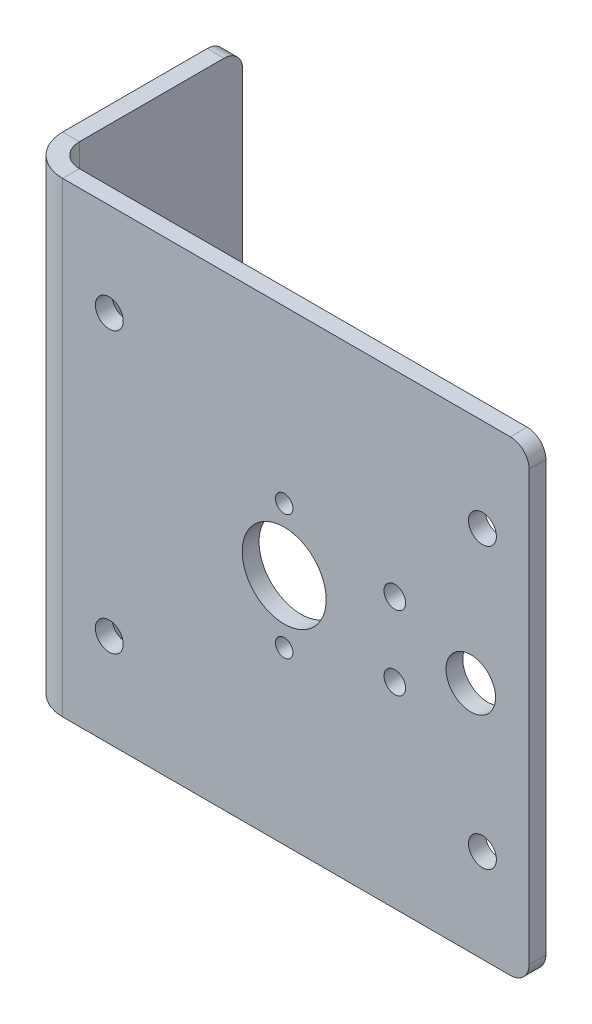
ISO-10303-21;
HEADER;
FILE_DESCRIPTION(('STEP AP214'),'2;1');
FILE_NAME('part.step','',(''),(''),'','','');
FILE_SCHEMA(('AUTOMOTIVE_DESIGN { 1 0 10303 214 1 1 1 1 }'));
ENDSEC;
DATA;
#1=APPLICATION_CONTEXT('core data for automotive mechanical design processes');
#2=APPLICATION_PROTOCOL_DEFINITION('international standard','automotive_design',2000,#1);
#3=PRODUCT_CONTEXT('',#1,'mechanical');
#4=PRODUCT('Part','Part','',(#3));
#5=PRODUCT_RELATED_PRODUCT_CATEGORY('part','',(#4));
#6=PRODUCT_DEFINITION_FORMATION('','',#4);
#7=PRODUCT_DEFINITION_CONTEXT('part definition',#1,'design');
#8=PRODUCT_DEFINITION('design','',#6,#7);
#9=PRODUCT_DEFINITION_SHAPE('','',#8);
#10=(LENGTH_UNIT() NAMED_UNIT(*) SI_UNIT(.MILLI.,.METRE.));
#11=(NAMED_UNIT(*) PLANE_ANGLE_UNIT() SI_UNIT($,.RADIAN.));
#12=(NAMED_UNIT(*) SI_UNIT($,.STERADIAN.) SOLID_ANGLE_UNIT());
#13=UNCERTAINTY_MEASURE_WITH_UNIT(LENGTH_MEASURE(1.E-05),#10,'distance_accuracy_value','');
#14=(GEOMETRIC_REPRESENTATION_CONTEXT(3) GLOBAL_UNCERTAINTY_ASSIGNED_CONTEXT((#13)) GLOBAL_UNIT_ASSIGNED_CONTEXT((#10,
#11,#12)) REPRESENTATION_CONTEXT('',''));
#15=CARTESIAN_POINT('',(0.,0.,0.));
#16=DIRECTION('',(0.,0.,1.));
#17=DIRECTION('',(1.,0.,0.));
#18=AXIS2_PLACEMENT_3D('',#15,#16,#17);
#19=CARTESIAN_POINT('',(-30.1625,31.75,0.));
#20=DIRECTION('',(0.,1.,0.));
#21=DIRECTION('',(0.,0.,1.));
#22=AXIS2_PLACEMENT_3D('',#19,#20,#21);
#23=PLANE('',#22);
#24=DIRECTION('',(0.,0.,1.));
#25=VECTOR('',#24,1.);
#26=CARTESIAN_POINT('',(-30.1625,31.75,0.));
#27=LINE('',#26,#25);
#28=CARTESIAN_POINT('',(-30.1625,31.75,0.));
#29=VERTEX_POINT('',#28);
#30=CARTESIAN_POINT('',(-30.1625,31.75,2.28600000000001));
#31=VERTEX_POINT('',#30);
#32=EDGE_CURVE('E146',#29,#31,#27,.T.);
#33=ORIENTED_EDGE('',*,*,#32,.F.);
#34=CARTESIAN_POINT('',(-30.1625,31.75,-3.17499999999999));
#35=DIRECTION('',(0.,1.,0.));
#36=DIRECTION('',(0.,0.,1.));
#37=AXIS2_PLACEMENT_3D('',#34,#35,#36);
#38=CIRCLE('',#37,3.175);
#39=CARTESIAN_POINT('',(-33.3375,31.75,-3.17499999999999));
#40=VERTEX_POINT('',#39);
#41=EDGE_CURVE('E144',#29,#40,#38,.F.);
#42=ORIENTED_EDGE('',*,*,#41,.T.);
#43=DIRECTION('',(1.,0.,0.));
#44=VECTOR('',#43,1.);
#45=CARTESIAN_POINT('',(-35.6235,31.75,-3.17499999999999));
#46=LINE('',#45,#44);
#47=CARTESIAN_POINT('',(-35.6235,31.75,-3.17499999999999));
#48=VERTEX_POINT('',#47);
#49=EDGE_CURVE('E138',#48,#40,#46,.T.);
#50=ORIENTED_EDGE('',*,*,#49,.F.);
#51=CARTESIAN_POINT('',(-30.1625,31.75,-3.17499999999999));
#52=DIRECTION('',(0.,1.,0.));
#53=DIRECTION('',(-1.,0.,0.));
#54=AXIS2_PLACEMENT_3D('',#51,#52,#53);
#55=CIRCLE('',#54,5.461);
#56=EDGE_CURVE('E142',#31,#48,#55,.F.);
#57=ORIENTED_EDGE('',*,*,#56,.F.);
#58=EDGE_LOOP('',(#33,#42,#50,#57));
#59=FACE_BOUND('',#58,.T.);
#60=ADVANCED_FACE('F45',(#59),#23,.T.);
#61=CARTESIAN_POINT('',(-35.6235,31.75,-3.17499999999999));
#62=DIRECTION('',(0.,1.,0.));
#63=DIRECTION('',(0.,0.,1.));
#64=AXIS2_PLACEMENT_3D('',#61,#62,#63);
#65=PLANE('',#64);
#66=DIRECTION('',(-1.,0.,0.));
#67=VECTOR('',#66,1.);
#68=CARTESIAN_POINT('',(33.3375,31.75,2.286));
#69=LINE('',#68,#67);
#70=CARTESIAN_POINT('',(30.7975,31.75,2.286));
#71=VERTEX_POINT('',#70);
#72=EDGE_CURVE('E170',#71,#31,#69,.T.);
#73=ORIENTED_EDGE('',*,*,#72,.F.);
#74=DIRECTION('',(0.,0.,1.));
#75=VECTOR('',#74,1.);
#76=CARTESIAN_POINT('',(30.7975,31.75,-3.17499999999999));
#77=LINE('',#76,#75);
#78=CARTESIAN_POINT('',(30.7975,31.75,0.));
#79=VERTEX_POINT('',#78);
#80=EDGE_CURVE('E11',#71,#79,#77,.F.);
#81=ORIENTED_EDGE('',*,*,#80,.T.);
#82=DIRECTION('',(-1.,0.,0.));
#83=VECTOR('',#82,1.);
#84=CARTESIAN_POINT('',(33.3375,31.75,0.));
#85=LINE('',#84,#83);
#86=EDGE_CURVE('E172',#79,#29,#85,.T.);
#87=ORIENTED_EDGE('',*,*,#86,.T.);
#88=ORIENTED_EDGE('',*,*,#32,.T.);
#89=EDGE_LOOP('',(#73,#81,#87,#88));
#90=FACE_BOUND('',#89,.T.);
#91=ADVANCED_FACE('F342',(#90),#65,.T.);
#92=CARTESIAN_POINT('',(-33.3375,-31.75,-3.17499999999999));
#93=DIRECTION('',(0.,-1.,0.));
#94=DIRECTION('',(0.,0.,-1.));
#95=AXIS2_PLACEMENT_3D('',#92,#93,#94);
#96=PLANE('',#95);
#97=DIRECTION('',(-1.,0.,0.));
#98=VECTOR('',#97,1.);
#99=CARTESIAN_POINT('',(-33.3375,-31.75,-3.17499999999999));
#100=LINE('',#99,#98);
#101=CARTESIAN_POINT('',(-33.3375,-31.75,-3.17499999999999));
#102=VERTEX_POINT('',#101);
#103=CARTESIAN_POINT('',(-35.6235,-31.75,-3.17499999999999));
#104=VERTEX_POINT('',#103);
#105=EDGE_CURVE('E147',#102,#104,#100,.T.);
#106=ORIENTED_EDGE('',*,*,#105,.F.);
#107=CARTESIAN_POINT('',(-30.1625,-31.75,-3.17499999999999));
#108=DIRECTION('',(0.,1.,0.));
#109=DIRECTION('',(0.,0.,1.));
#110=AXIS2_PLACEMENT_3D('',#107,#108,#109);
#111=CIRCLE('',#110,3.175);
#112=CARTESIAN_POINT('',(-30.1625,-31.75,0.));
#113=VERTEX_POINT('',#112);
#114=EDGE_CURVE('E190',#113,#102,#111,.F.);
#115=ORIENTED_EDGE('',*,*,#114,.F.);
#116=DIRECTION('',(0.,0.,-1.));
#117=VECTOR('',#116,1.);
#118=CARTESIAN_POINT('',(-30.1625,-31.75,2.28600000000001));
#119=LINE('',#118,#117);
#120=CARTESIAN_POINT('',(-30.1625,-31.75,2.28600000000001));
#121=VERTEX_POINT('',#120);
#122=EDGE_CURVE('E208',#121,#113,#119,.T.);
#123=ORIENTED_EDGE('',*,*,#122,.F.);
#124=CARTESIAN_POINT('',(-30.1625,-31.75,-3.17499999999999));
#125=DIRECTION('',(0.,1.,0.));
#126=DIRECTION('',(-1.,0.,0.));
#127=AXIS2_PLACEMENT_3D('',#124,#125,#126);
#128=CIRCLE('',#127,5.461);
#129=EDGE_CURVE('E184',#121,#104,#128,.F.);
#130=ORIENTED_EDGE('',*,*,#129,.T.);
#131=EDGE_LOOP('',(#106,#115,#123,#130));
#132=FACE_BOUND('',#131,.T.);
#133=ADVANCED_FACE('F321',(#132),#96,.T.);
#134=CARTESIAN_POINT('',(-30.1625,-31.75,2.28600000000001));
#135=DIRECTION('',(0.,-1.,0.));
#136=DIRECTION('',(0.,0.,-1.));
#137=AXIS2_PLACEMENT_3D('',#134,#135,#136);
#138=PLANE('',#137);
#139=DIRECTION('',(0.,0.,1.));
#140=VECTOR('',#139,1.);
#141=CARTESIAN_POINT('',(-35.6235,-31.75,0.));
#142=LINE('',#141,#140);
#143=CARTESIAN_POINT('',(-35.6235,-31.75,-22.86));
#144=VERTEX_POINT('',#143);
#145=EDGE_CURVE('E157',#104,#144,#142,.F.);
#146=ORIENTED_EDGE('',*,*,#145,.T.);
#147=DIRECTION('',(1.,0.,0.));
#148=VECTOR('',#147,1.);
#149=CARTESIAN_POINT('',(-30.1625,-31.75,-22.86));
#150=LINE('',#149,#148);
#151=CARTESIAN_POINT('',(-33.3375,-31.75,-22.86));
#152=VERTEX_POINT('',#151);
#153=EDGE_CURVE('E230',#144,#152,#150,.T.);
#154=ORIENTED_EDGE('',*,*,#153,.T.);
#155=DIRECTION('',(0.,0.,-1.));
#156=VECTOR('',#155,1.);
#157=CARTESIAN_POINT('',(-33.3375,-31.75,0.));
#158=LINE('',#157,#156);
#159=EDGE_CURVE('E179',#102,#152,#158,.T.);
#160=ORIENTED_EDGE('',*,*,#159,.F.);
#161=ORIENTED_EDGE('',*,*,#105,.T.);
#162=EDGE_LOOP('',(#146,#154,#160,#161));
#163=FACE_BOUND('',#162,.T.);
#164=ADVANCED_FACE('F318',(#163),#138,.T.);
#165=CARTESIAN_POINT('',(-33.3375,31.75,0.));
#166=DIRECTION('',(-1.,0.,0.));
#167=DIRECTION('',(0.,0.,1.));
#168=AXIS2_PLACEMENT_3D('',#165,#166,#167);
#169=PLANE('',#168);
#170=ORIENTED_EDGE('',*,*,#159,.T.);
#171=CARTESIAN_POINT('',(-33.3375,-29.21,-22.86));
#172=DIRECTION('',(-1.,0.,0.));
#173=DIRECTION('',(0.,0.,1.));
#174=AXIS2_PLACEMENT_3D('',#171,#172,#173);
#175=CIRCLE('',#174,2.54);
#176=CARTESIAN_POINT('',(-33.3375,-29.21,-25.4));
#177=VERTEX_POINT('',#176);
#178=EDGE_CURVE('E235',#152,#177,#175,.F.);
#179=ORIENTED_EDGE('',*,*,#178,.T.);
#180=DIRECTION('',(0.,-1.,0.));
#181=VECTOR('',#180,1.);
#182=CARTESIAN_POINT('',(-33.3375,31.75,-25.4));
#183=LINE('',#182,#181);
#184=CARTESIAN_POINT('',(-33.3375,29.21,-25.4));
#185=VERTEX_POINT('',#184);
#186=EDGE_CURVE('E206',#185,#177,#183,.T.);
#187=ORIENTED_EDGE('',*,*,#186,.F.);
#188=CARTESIAN_POINT('',(-33.3375,29.21,-22.86));
#189=DIRECTION('',(-1.,0.,0.));
#190=DIRECTION('',(0.,0.,1.));
#191=AXIS2_PLACEMENT_3D('',#188,#189,#190);
#192=CIRCLE('',#191,2.54);
#193=CARTESIAN_POINT('',(-33.3375,31.75,-22.86));
#194=VERTEX_POINT('',#193);
#195=EDGE_CURVE('E233',#185,#194,#192,.F.);
#196=ORIENTED_EDGE('',*,*,#195,.T.);
#197=DIRECTION('',(0.,0.,-1.));
#198=VECTOR('',#197,1.);
#199=CARTESIAN_POINT('',(-33.3375,31.75,0.));
#200=LINE('',#199,#198);
#201=EDGE_CURVE('E165',#40,#194,#200,.T.);
#202=ORIENTED_EDGE('',*,*,#201,.F.);
#203=DIRECTION('',(0.,-1.,0.));
#204=VECTOR('',#203,1.);
#205=CARTESIAN_POINT('',(-33.3375,31.75,-3.17499999999999));
#206=LINE('',#205,#204);
#207=EDGE_CURVE('E178',#40,#102,#206,.T.);
#208=ORIENTED_EDGE('',*,*,#207,.T.);
#209=EDGE_LOOP('',(#170,#179,#187,#196,#202,#208));
#210=FACE_BOUND('',#209,.T.);
#211=ADVANCED_FACE('F312',(#210),#169,.F.);
#212=CARTESIAN_POINT('',(-35.6235,31.75,-25.4));
#213=DIRECTION('',(0.,0.,-1.));
#214=DIRECTION('',(-1.,0.,0.));
#215=AXIS2_PLACEMENT_3D('',#212,#213,#214);
#216=PLANE('',#215);
#217=ORIENTED_EDGE('',*,*,#186,.T.);
#218=DIRECTION('',(1.,0.,0.));
#219=VECTOR('',#218,1.);
#220=CARTESIAN_POINT('',(-35.6235,-29.21,-25.4));
#221=LINE('',#220,#219);
#222=CARTESIAN_POINT('',(-35.6235,-29.21,-25.4));
#223=VERTEX_POINT('',#222);
#224=EDGE_CURVE('E69',#177,#223,#221,.F.);
#225=ORIENTED_EDGE('',*,*,#224,.T.);
#226=DIRECTION('',(0.,-1.,0.));
#227=VECTOR('',#226,1.);
#228=CARTESIAN_POINT('',(-35.6235,31.75,-25.4));
#229=LINE('',#228,#227);
#230=CARTESIAN_POINT('',(-35.6235,29.21,-25.4));
#231=VERTEX_POINT('',#230);
#232=EDGE_CURVE('E161',#231,#223,#229,.T.);
#233=ORIENTED_EDGE('',*,*,#232,.F.);
#234=DIRECTION('',(1.,0.,0.));
#235=VECTOR('',#234,1.);
#236=CARTESIAN_POINT('',(-35.6235,29.21,-25.4));
#237=LINE('',#236,#235);
#238=EDGE_CURVE('E237',#231,#185,#237,.T.);
#239=ORIENTED_EDGE('',*,*,#238,.T.);
#240=EDGE_LOOP('',(#217,#225,#233,#239));
#241=FACE_BOUND('',#240,.T.);
#242=ADVANCED_FACE('F310',(#241),#216,.T.);
#243=CARTESIAN_POINT('',(-35.6235,31.75,0.));
#244=DIRECTION('',(-1.,0.,0.));
#245=DIRECTION('',(0.,0.,1.));
#246=AXIS2_PLACEMENT_3D('',#243,#244,#245);
#247=PLANE('',#246);
#248=ORIENTED_EDGE('',*,*,#232,.T.);
#249=CARTESIAN_POINT('',(-35.6235,-29.21,-22.86));
#250=DIRECTION('',(-1.,0.,0.));
#251=DIRECTION('',(0.,0.,1.));
#252=AXIS2_PLACEMENT_3D('',#249,#250,#251);
#253=CIRCLE('',#252,2.54);
#254=EDGE_CURVE('E243',#223,#144,#253,.T.);
#255=ORIENTED_EDGE('',*,*,#254,.T.);
#256=ORIENTED_EDGE('',*,*,#145,.F.);
#257=DIRECTION('',(0.,-1.,0.));
#258=VECTOR('',#257,1.);
#259=CARTESIAN_POINT('',(-35.6235,31.75,-3.17499999999999));
#260=LINE('',#259,#258);
#261=EDGE_CURVE('E152',#48,#104,#260,.T.);
#262=ORIENTED_EDGE('',*,*,#261,.F.);
#263=DIRECTION('',(0.,0.,1.));
#264=VECTOR('',#263,1.);
#265=CARTESIAN_POINT('',(-35.6235,31.75,0.));
#266=LINE('',#265,#264);
#267=CARTESIAN_POINT('',(-35.6235,31.75,-22.86));
#268=VERTEX_POINT('',#267);
#269=EDGE_CURVE('E154',#48,#268,#266,.F.);
#270=ORIENTED_EDGE('',*,*,#269,.T.);
#271=CARTESIAN_POINT('',(-35.6235,29.21,-22.86));
#272=DIRECTION('',(-1.,0.,0.));
#273=DIRECTION('',(0.,0.,1.));
#274=AXIS2_PLACEMENT_3D('',#271,#272,#273);
#275=CIRCLE('',#274,2.54);
#276=EDGE_CURVE('E241',#268,#231,#275,.T.);
#277=ORIENTED_EDGE('',*,*,#276,.T.);
#278=EDGE_LOOP('',(#248,#255,#256,#262,#270,#277));
#279=FACE_BOUND('',#278,.T.);
#280=ADVANCED_FACE('F153',(#279),#247,.T.);
#281=CARTESIAN_POINT('',(-30.1625,31.75,-3.17499999999999));
#282=DIRECTION('',(0.,-1.,0.));
#283=DIRECTION('',(0.,0.,-1.));
#284=AXIS2_PLACEMENT_3D('',#281,#282,#283);
#285=CYLINDRICAL_SURFACE('',#284,5.461);
#286=ORIENTED_EDGE('',*,*,#129,.F.);
#287=DIRECTION('',(0.,-1.,0.));
#288=VECTOR('',#287,1.);
#289=CARTESIAN_POINT('',(-30.1625,31.75,2.28600000000001));
#290=LINE('',#289,#288);
#291=EDGE_CURVE('E162',#31,#121,#290,.T.);
#292=ORIENTED_EDGE('',*,*,#291,.F.);
#293=ORIENTED_EDGE('',*,*,#56,.T.);
#294=ORIENTED_EDGE('',*,*,#261,.T.);
#295=EDGE_LOOP('',(#286,#292,#293,#294));
#296=FACE_BOUND('',#295,.T.);
#297=ADVANCED_FACE('F168',(#296),#285,.T.);
#298=CARTESIAN_POINT('',(33.3375,31.75,2.286));
#299=DIRECTION('',(0.,0.,1.));
#300=DIRECTION('',(1.,0.,0.));
#301=AXIS2_PLACEMENT_3D('',#298,#299,#300);
#302=PLANE('',#301);
#303=CARTESIAN_POINT('',(15.0578841816037,5.027499276321,2.28600000000001));
#304=DIRECTION('',(0.,0.,1.));
#305=DIRECTION('',(1.,0.,0.));
#306=AXIS2_PLACEMENT_3D('',#303,#304,#305);
#307=CIRCLE('',#306,1.4732);
#308=CARTESIAN_POINT('',(16.5310841816037,5.027499276321,2.28600000000001));
#309=VERTEX_POINT('',#308);
#310=EDGE_CURVE('E276',#309,#309,#307,.T.);
#311=ORIENTED_EDGE('',*,*,#310,.F.);
#312=EDGE_LOOP('',(#311));
#313=FACE_BOUND('',#312,.T.);
#314=CARTESIAN_POINT('',(15.0578841816037,-5.027499276321,2.28600000000001));
#315=DIRECTION('',(0.,0.,1.));
#316=DIRECTION('',(1.,0.,0.));
#317=AXIS2_PLACEMENT_3D('',#314,#315,#316);
#318=CIRCLE('',#317,1.4732);
#319=CARTESIAN_POINT('',(16.5310841816037,-5.027499276321,2.28600000000001));
#320=VERTEX_POINT('',#319);
#321=EDGE_CURVE('E265',#320,#320,#318,.T.);
#322=ORIENTED_EDGE('',*,*,#321,.F.);
#323=EDGE_LOOP('',(#322));
#324=FACE_BOUND('',#323,.T.);
#325=CARTESIAN_POINT('',(0.,8.5,2.28600000000001));
#326=DIRECTION('',(0.,0.,1.));
#327=DIRECTION('',(1.,0.,0.));
#328=AXIS2_PLACEMENT_3D('',#325,#326,#327);
#329=CIRCLE('',#328,1.190625);
#330=CARTESIAN_POINT('',(1.190625,8.5,2.28600000000001));
#331=VERTEX_POINT('',#330);
#332=EDGE_CURVE('E264',#331,#331,#329,.T.);
#333=ORIENTED_EDGE('',*,*,#332,.F.);
#334=EDGE_LOOP('',(#333));
#335=FACE_BOUND('',#334,.T.);
#336=CARTESIAN_POINT('',(0.,-8.5,2.28600000000001));
#337=DIRECTION('',(0.,0.,1.));
#338=DIRECTION('',(1.,0.,0.));
#339=AXIS2_PLACEMENT_3D('',#336,#337,#338);
#340=CIRCLE('',#339,1.190625);
#341=CARTESIAN_POINT('',(1.190625,-8.5,2.28600000000001));
#342=VERTEX_POINT('',#341);
#343=EDGE_CURVE('E281',#342,#342,#340,.T.);
#344=ORIENTED_EDGE('',*,*,#343,.F.);
#345=EDGE_LOOP('',(#344));
#346=FACE_BOUND('',#345,.T.);
#347=CARTESIAN_POINT('',(25.4,0.,2.28600000000001));
#348=DIRECTION('',(0.,0.,1.));
#349=DIRECTION('',(1.,0.,0.));
#350=AXIS2_PLACEMENT_3D('',#347,#348,#349);
#351=CIRCLE('',#350,3.373501);
#352=CARTESIAN_POINT('',(28.773501,0.,2.28600000000001));
#353=VERTEX_POINT('',#352);
#354=EDGE_CURVE('E287',#353,#353,#351,.T.);
#355=ORIENTED_EDGE('',*,*,#354,.F.);
#356=EDGE_LOOP('',(#355));
#357=FACE_BOUND('',#356,.T.);
#358=CARTESIAN_POINT('',(0.,0.,2.28600000000001));
#359=DIRECTION('',(0.,0.,1.));
#360=DIRECTION('',(1.,0.,0.));
#361=AXIS2_PLACEMENT_3D('',#358,#359,#360);
#362=CIRCLE('',#361,5.715);
#363=CARTESIAN_POINT('',(5.715,0.,2.28600000000001));
#364=VERTEX_POINT('',#363);
#365=EDGE_CURVE('E261',#364,#364,#362,.T.);
#366=ORIENTED_EDGE('',*,*,#365,.F.);
#367=EDGE_LOOP('',(#366));
#368=FACE_BOUND('',#367,.T.);
#369=CARTESIAN_POINT('',(-23.8125,19.05,2.28600000000001));
#370=DIRECTION('',(0.,0.,1.));
#371=DIRECTION('',(1.,0.,0.));
#372=AXIS2_PLACEMENT_3D('',#369,#370,#371);
#373=CIRCLE('',#372,1.89865);
#374=CARTESIAN_POINT('',(-21.91385,19.05,2.28600000000001));
#375=VERTEX_POINT('',#374);
#376=EDGE_CURVE('E258',#375,#375,#373,.T.);
#377=ORIENTED_EDGE('',*,*,#376,.F.);
#378=EDGE_LOOP('',(#377));
#379=FACE_BOUND('',#378,.T.);
#380=CARTESIAN_POINT('',(26.9875,19.05,2.28600000000001));
#381=DIRECTION('',(0.,0.,1.));
#382=DIRECTION('',(1.,0.,0.));
#383=AXIS2_PLACEMENT_3D('',#380,#381,#382);
#384=CIRCLE('',#383,1.89865);
#385=CARTESIAN_POINT('',(28.88615,19.05,2.28600000000001));
#386=VERTEX_POINT('',#385);
#387=EDGE_CURVE('E254',#386,#386,#384,.T.);
#388=ORIENTED_EDGE('',*,*,#387,.F.);
#389=EDGE_LOOP('',(#388));
#390=FACE_BOUND('',#389,.T.);
#391=CARTESIAN_POINT('',(26.9875,-19.05,2.28600000000001));
#392=DIRECTION('',(0.,0.,1.));
#393=DIRECTION('',(1.,0.,0.));
#394=AXIS2_PLACEMENT_3D('',#391,#392,#393);
#395=CIRCLE('',#394,1.89865);
#396=CARTESIAN_POINT('',(28.88615,-19.05,2.28600000000001));
#397=VERTEX_POINT('',#396);
#398=EDGE_CURVE('E250',#397,#397,#395,.T.);
#399=ORIENTED_EDGE('',*,*,#398,.F.);
#400=EDGE_LOOP('',(#399));
#401=FACE_BOUND('',#400,.T.);
#402=CARTESIAN_POINT('',(-23.8125,-19.05,2.28600000000001));
#403=DIRECTION('',(0.,0.,1.));
#404=DIRECTION('',(1.,0.,0.));
#405=AXIS2_PLACEMENT_3D('',#402,#403,#404);
#406=CIRCLE('',#405,1.89865);
#407=CARTESIAN_POINT('',(-21.91385,-19.05,2.28600000000001));
#408=VERTEX_POINT('',#407);
#409=EDGE_CURVE('E249',#408,#408,#406,.T.);
#410=ORIENTED_EDGE('',*,*,#409,.F.);
#411=EDGE_LOOP('',(#410));
#412=FACE_BOUND('',#411,.T.);
#413=DIRECTION('',(-1.,0.,0.));
#414=VECTOR('',#413,1.);
#415=CARTESIAN_POINT('',(33.3375,-31.75,2.286));
#416=LINE('',#415,#414);
#417=CARTESIAN_POINT('',(30.7975,-31.75,2.286));
#418=VERTEX_POINT('',#417);
#419=EDGE_CURVE('E186',#418,#121,#416,.T.);
#420=ORIENTED_EDGE('',*,*,#419,.F.);
#421=CARTESIAN_POINT('',(30.7975,-29.21,2.286));
#422=DIRECTION('',(0.,0.,1.));
#423=DIRECTION('',(1.,0.,0.));
#424=AXIS2_PLACEMENT_3D('',#421,#422,#423);
#425=CIRCLE('',#424,2.54);
#426=CARTESIAN_POINT('',(33.3375,-29.21,2.286));
#427=VERTEX_POINT('',#426);
#428=EDGE_CURVE('E219',#418,#427,#425,.T.);
#429=ORIENTED_EDGE('',*,*,#428,.T.);
#430=DIRECTION('',(0.,-1.,0.));
#431=VECTOR('',#430,1.);
#432=CARTESIAN_POINT('',(33.3375,31.75,2.286));
#433=LINE('',#432,#431);
#434=CARTESIAN_POINT('',(33.3375,29.21,2.286));
#435=VERTEX_POINT('',#434);
#436=EDGE_CURVE('E201',#435,#427,#433,.T.);
#437=ORIENTED_EDGE('',*,*,#436,.F.);
#438=CARTESIAN_POINT('',(30.7975,29.21,2.286));
#439=DIRECTION('',(0.,0.,1.));
#440=DIRECTION('',(1.,0.,0.));
#441=AXIS2_PLACEMENT_3D('',#438,#439,#440);
#442=CIRCLE('',#441,2.54);
#443=EDGE_CURVE('E217',#435,#71,#442,.T.);
#444=ORIENTED_EDGE('',*,*,#443,.T.);
#445=ORIENTED_EDGE('',*,*,#72,.T.);
#446=ORIENTED_EDGE('',*,*,#291,.T.);
#447=EDGE_LOOP('',(#420,#429,#437,#444,#445,#446));
#448=FACE_BOUND('',#447,.T.);
#449=ADVANCED_FACE('F337',(#313,#324,#335,#346,#357,#368,#379,#390,#401,#412,#448),#302,.T.);
#450=CARTESIAN_POINT('',(33.3375,31.75,0.));
#451=DIRECTION('',(1.,0.,0.));
#452=DIRECTION('',(0.,0.,-1.));
#453=AXIS2_PLACEMENT_3D('',#450,#451,#452);
#454=PLANE('',#453);
#455=ORIENTED_EDGE('',*,*,#436,.T.);
#456=DIRECTION('',(0.,0.,1.));
#457=VECTOR('',#456,1.);
#458=CARTESIAN_POINT('',(33.3375,-29.21,0.));
#459=LINE('',#458,#457);
#460=CARTESIAN_POINT('',(33.3375,-29.21,0.));
#461=VERTEX_POINT('',#460);
#462=EDGE_CURVE('E224',#427,#461,#459,.F.);
#463=ORIENTED_EDGE('',*,*,#462,.T.);
#464=DIRECTION('',(0.,-1.,0.));
#465=VECTOR('',#464,1.);
#466=CARTESIAN_POINT('',(33.3375,31.75,0.));
#467=LINE('',#466,#465);
#468=CARTESIAN_POINT('',(33.3375,29.21,0.));
#469=VERTEX_POINT('',#468);
#470=EDGE_CURVE('E198',#469,#461,#467,.T.);
#471=ORIENTED_EDGE('',*,*,#470,.F.);
#472=DIRECTION('',(0.,0.,1.));
#473=VECTOR('',#472,1.);
#474=CARTESIAN_POINT('',(33.3375,29.21,0.));
#475=LINE('',#474,#473);
#476=EDGE_CURVE('E221',#469,#435,#475,.T.);
#477=ORIENTED_EDGE('',*,*,#476,.T.);
#478=EDGE_LOOP('',(#455,#463,#471,#477));
#479=FACE_BOUND('',#478,.T.);
#480=ADVANCED_FACE('F347',(#479),#454,.T.);
#481=CARTESIAN_POINT('',(33.3375,31.75,0.));
#482=DIRECTION('',(0.,0.,1.));
#483=DIRECTION('',(1.,0.,0.));
#484=AXIS2_PLACEMENT_3D('',#481,#482,#483);
#485=PLANE('',#484);
#486=CARTESIAN_POINT('',(15.0578841816037,5.027499276321,0.));
#487=DIRECTION('',(0.,0.,1.));
#488=DIRECTION('',(1.,0.,0.));
#489=AXIS2_PLACEMENT_3D('',#486,#487,#488);
#490=CIRCLE('',#489,1.47319999999999);
#491=CARTESIAN_POINT('',(16.5310841816037,5.027499276321,0.));
#492=VERTEX_POINT('',#491);
#493=EDGE_CURVE('E49',#492,#492,#490,.T.);
#494=ORIENTED_EDGE('',*,*,#493,.T.);
#495=EDGE_LOOP('',(#494));
#496=FACE_BOUND('',#495,.T.);
#497=CARTESIAN_POINT('',(15.0578841816037,-5.027499276321,0.));
#498=DIRECTION('',(0.,0.,1.));
#499=DIRECTION('',(1.,0.,0.));
#500=AXIS2_PLACEMENT_3D('',#497,#498,#499);
#501=CIRCLE('',#500,1.47319999999999);
#502=CARTESIAN_POINT('',(16.5310841816037,-5.027499276321,0.));
#503=VERTEX_POINT('',#502);
#504=EDGE_CURVE('E262',#503,#503,#501,.T.);
#505=ORIENTED_EDGE('',*,*,#504,.T.);
#506=EDGE_LOOP('',(#505));
#507=FACE_BOUND('',#506,.T.);
#508=CARTESIAN_POINT('',(0.,8.5,0.));
#509=DIRECTION('',(0.,0.,1.));
#510=DIRECTION('',(1.,0.,0.));
#511=AXIS2_PLACEMENT_3D('',#508,#509,#510);
#512=CIRCLE('',#511,1.190625);
#513=CARTESIAN_POINT('',(1.190625,8.5,0.));
#514=VERTEX_POINT('',#513);
#515=EDGE_CURVE('E269',#514,#514,#512,.T.);
#516=ORIENTED_EDGE('',*,*,#515,.T.);
#517=EDGE_LOOP('',(#516));
#518=FACE_BOUND('',#517,.T.);
#519=CARTESIAN_POINT('',(0.,-8.5,0.));
#520=DIRECTION('',(0.,0.,1.));
#521=DIRECTION('',(1.,0.,0.));
#522=AXIS2_PLACEMENT_3D('',#519,#520,#521);
#523=CIRCLE('',#522,1.190625);
#524=CARTESIAN_POINT('',(1.190625,-8.5,0.));
#525=VERTEX_POINT('',#524);
#526=EDGE_CURVE('E284',#525,#525,#523,.T.);
#527=ORIENTED_EDGE('',*,*,#526,.T.);
#528=EDGE_LOOP('',(#527));
#529=FACE_BOUND('',#528,.T.);
#530=CARTESIAN_POINT('',(25.4,0.,0.));
#531=DIRECTION('',(0.,0.,1.));
#532=DIRECTION('',(1.,0.,0.));
#533=AXIS2_PLACEMENT_3D('',#530,#531,#532);
#534=CIRCLE('',#533,3.373501);
#535=CARTESIAN_POINT('',(28.773501,0.,0.));
#536=VERTEX_POINT('',#535);
#537=EDGE_CURVE('E290',#536,#536,#534,.T.);
#538=ORIENTED_EDGE('',*,*,#537,.T.);
#539=EDGE_LOOP('',(#538));
#540=FACE_BOUND('',#539,.T.);
#541=CARTESIAN_POINT('',(0.,0.,0.));
#542=DIRECTION('',(0.,0.,1.));
#543=DIRECTION('',(1.,0.,0.));
#544=AXIS2_PLACEMENT_3D('',#541,#542,#543);
#545=CIRCLE('',#544,5.715);
#546=CARTESIAN_POINT('',(5.715,0.,0.));
#547=VERTEX_POINT('',#546);
#548=EDGE_CURVE('E259',#547,#547,#545,.T.);
#549=ORIENTED_EDGE('',*,*,#548,.T.);
#550=EDGE_LOOP('',(#549));
#551=FACE_BOUND('',#550,.T.);
#552=CARTESIAN_POINT('',(-23.8125,19.05,0.));
#553=DIRECTION('',(0.,0.,1.));
#554=DIRECTION('',(1.,0.,0.));
#555=AXIS2_PLACEMENT_3D('',#552,#553,#554);
#556=CIRCLE('',#555,1.89865);
#557=CARTESIAN_POINT('',(-21.91385,19.05,0.));
#558=VERTEX_POINT('',#557);
#559=EDGE_CURVE('E255',#558,#558,#556,.T.);
#560=ORIENTED_EDGE('',*,*,#559,.T.);
#561=EDGE_LOOP('',(#560));
#562=FACE_BOUND('',#561,.T.);
#563=CARTESIAN_POINT('',(26.9875,19.05,0.));
#564=DIRECTION('',(0.,0.,1.));
#565=DIRECTION('',(1.,0.,0.));
#566=AXIS2_PLACEMENT_3D('',#563,#564,#565);
#567=CIRCLE('',#566,1.89865);
#568=CARTESIAN_POINT('',(28.88615,19.05,0.));
#569=VERTEX_POINT('',#568);
#570=EDGE_CURVE('E251',#569,#569,#567,.T.);
#571=ORIENTED_EDGE('',*,*,#570,.T.);
#572=EDGE_LOOP('',(#571));
#573=FACE_BOUND('',#572,.T.);
#574=CARTESIAN_POINT('',(26.9875,-19.05,0.));
#575=DIRECTION('',(0.,0.,1.));
#576=DIRECTION('',(1.,0.,0.));
#577=AXIS2_PLACEMENT_3D('',#574,#575,#576);
#578=CIRCLE('',#577,1.89865);
#579=CARTESIAN_POINT('',(28.88615,-19.05,0.));
#580=VERTEX_POINT('',#579);
#581=EDGE_CURVE('E246',#580,#580,#578,.T.);
#582=ORIENTED_EDGE('',*,*,#581,.T.);
#583=EDGE_LOOP('',(#582));
#584=FACE_BOUND('',#583,.T.);
#585=CARTESIAN_POINT('',(-23.8125,-19.05,0.));
#586=DIRECTION('',(0.,0.,1.));
#587=DIRECTION('',(1.,0.,0.));
#588=AXIS2_PLACEMENT_3D('',#585,#586,#587);
#589=CIRCLE('',#588,1.89865);
#590=CARTESIAN_POINT('',(-21.91385,-19.05,0.));
#591=VERTEX_POINT('',#590);
#592=EDGE_CURVE('E182',#591,#591,#589,.T.);
#593=ORIENTED_EDGE('',*,*,#592,.T.);
#594=EDGE_LOOP('',(#593));
#595=FACE_BOUND('',#594,.T.);
#596=ORIENTED_EDGE('',*,*,#470,.T.);
#597=CARTESIAN_POINT('',(30.7975,-29.21,0.));
#598=DIRECTION('',(0.,0.,1.));
#599=DIRECTION('',(1.,0.,0.));
#600=AXIS2_PLACEMENT_3D('',#597,#598,#599);
#601=CIRCLE('',#600,2.54);
#602=CARTESIAN_POINT('',(30.7975,-31.75,0.));
#603=VERTEX_POINT('',#602);
#604=EDGE_CURVE('E228',#461,#603,#601,.F.);
#605=ORIENTED_EDGE('',*,*,#604,.T.);
#606=DIRECTION('',(-1.,0.,0.));
#607=VECTOR('',#606,1.);
#608=CARTESIAN_POINT('',(33.3375,-31.75,0.));
#609=LINE('',#608,#607);
#610=EDGE_CURVE('E188',#603,#113,#609,.T.);
#611=ORIENTED_EDGE('',*,*,#610,.T.);
#612=DIRECTION('',(0.,-1.,0.));
#613=VECTOR('',#612,1.);
#614=CARTESIAN_POINT('',(-30.1625,31.75,0.));
#615=LINE('',#614,#613);
#616=EDGE_CURVE('E195',#29,#113,#615,.T.);
#617=ORIENTED_EDGE('',*,*,#616,.F.);
#618=ORIENTED_EDGE('',*,*,#86,.F.);
#619=CARTESIAN_POINT('',(30.7975,29.21,0.));
#620=DIRECTION('',(0.,0.,1.));
#621=DIRECTION('',(1.,0.,0.));
#622=AXIS2_PLACEMENT_3D('',#619,#620,#621);
#623=CIRCLE('',#622,2.54);
#624=EDGE_CURVE('E226',#79,#469,#623,.F.);
#625=ORIENTED_EDGE('',*,*,#624,.T.);
#626=EDGE_LOOP('',(#596,#605,#611,#617,#618,#625));
#627=FACE_BOUND('',#626,.T.);
#628=ADVANCED_FACE('F328',(#496,#507,#518,#529,#540,#551,#562,#573,#584,#595,#627),#485,.F.);
#629=CARTESIAN_POINT('',(-30.1625,31.75,-3.17499999999999));
#630=DIRECTION('',(0.,-1.,0.));
#631=DIRECTION('',(0.,0.,-1.));
#632=AXIS2_PLACEMENT_3D('',#629,#630,#631);
#633=CYLINDRICAL_SURFACE('',#632,3.175);
#634=ORIENTED_EDGE('',*,*,#114,.T.);
#635=ORIENTED_EDGE('',*,*,#207,.F.);
#636=ORIENTED_EDGE('',*,*,#41,.F.);
#637=ORIENTED_EDGE('',*,*,#616,.T.);
#638=EDGE_LOOP('',(#634,#635,#636,#637));
#639=FACE_BOUND('',#638,.T.);
#640=ADVANCED_FACE('F324',(#639),#633,.F.);
#641=CARTESIAN_POINT('',(-30.1625,31.75,-3.17499999999999));
#642=DIRECTION('',(0.,1.,0.));
#643=DIRECTION('',(-1.,0.,0.));
#644=AXIS2_PLACEMENT_3D('',#641,#642,#643);
#645=PLANE('',#644);
#646=ORIENTED_EDGE('',*,*,#201,.T.);
#647=DIRECTION('',(1.,0.,0.));
#648=VECTOR('',#647,1.);
#649=CARTESIAN_POINT('',(-30.1625,31.75,-22.86));
#650=LINE('',#649,#648);
#651=EDGE_CURVE('E54',#194,#268,#650,.F.);
#652=ORIENTED_EDGE('',*,*,#651,.T.);
#653=ORIENTED_EDGE('',*,*,#269,.F.);
#654=ORIENTED_EDGE('',*,*,#49,.T.);
#655=EDGE_LOOP('',(#646,#652,#653,#654));
#656=FACE_BOUND('',#655,.T.);
#657=ADVANCED_FACE('F164',(#656),#645,.T.);
#658=CARTESIAN_POINT('',(-30.1625,-31.75,-3.17499999999999));
#659=DIRECTION('',(0.,1.,0.));
#660=DIRECTION('',(-1.,0.,0.));
#661=AXIS2_PLACEMENT_3D('',#658,#659,#660);
#662=PLANE('',#661);
#663=ORIENTED_EDGE('',*,*,#610,.F.);
#664=DIRECTION('',(0.,0.,1.));
#665=VECTOR('',#664,1.);
#666=CARTESIAN_POINT('',(30.7975,-31.75,2.286));
#667=LINE('',#666,#665);
#668=EDGE_CURVE('E214',#603,#418,#667,.T.);
#669=ORIENTED_EDGE('',*,*,#668,.T.);
#670=ORIENTED_EDGE('',*,*,#419,.T.);
#671=ORIENTED_EDGE('',*,*,#122,.T.);
#672=EDGE_LOOP('',(#663,#669,#670,#671));
#673=FACE_BOUND('',#672,.T.);
#674=ADVANCED_FACE('F334',(#673),#662,.F.);
#675=CARTESIAN_POINT('',(30.7975,-29.21,-3.17499999999999));
#676=DIRECTION('',(0.,0.,-1.));
#677=DIRECTION('',(-1.,0.,0.));
#678=AXIS2_PLACEMENT_3D('',#675,#676,#677);
#679=CYLINDRICAL_SURFACE('',#678,2.54);
#680=ORIENTED_EDGE('',*,*,#604,.F.);
#681=ORIENTED_EDGE('',*,*,#462,.F.);
#682=ORIENTED_EDGE('',*,*,#428,.F.);
#683=ORIENTED_EDGE('',*,*,#668,.F.);
#684=EDGE_LOOP('',(#680,#681,#682,#683));
#685=FACE_BOUND('',#684,.T.);
#686=ADVANCED_FACE('F350',(#685),#679,.T.);
#687=CARTESIAN_POINT('',(-30.1625,-29.21,-22.86));
#688=DIRECTION('',(1.,0.,0.));
#689=DIRECTION('',(0.,0.,-1.));
#690=AXIS2_PLACEMENT_3D('',#687,#688,#689);
#691=CYLINDRICAL_SURFACE('',#690,2.54);
#692=ORIENTED_EDGE('',*,*,#254,.F.);
#693=ORIENTED_EDGE('',*,*,#224,.F.);
#694=ORIENTED_EDGE('',*,*,#178,.F.);
#695=ORIENTED_EDGE('',*,*,#153,.F.);
#696=EDGE_LOOP('',(#692,#693,#694,#695));
#697=FACE_BOUND('',#696,.T.);
#698=ADVANCED_FACE('F316',(#697),#691,.T.);
#699=CARTESIAN_POINT('',(-35.6235,29.21,-22.86));
#700=DIRECTION('',(1.,0.,0.));
#701=DIRECTION('',(0.,0.,-1.));
#702=AXIS2_PLACEMENT_3D('',#699,#700,#701);
#703=CYLINDRICAL_SURFACE('',#702,2.54);
#704=ORIENTED_EDGE('',*,*,#276,.F.);
#705=ORIENTED_EDGE('',*,*,#651,.F.);
#706=ORIENTED_EDGE('',*,*,#195,.F.);
#707=ORIENTED_EDGE('',*,*,#238,.F.);
#708=EDGE_LOOP('',(#704,#705,#706,#707));
#709=FACE_BOUND('',#708,.T.);
#710=ADVANCED_FACE('F307',(#709),#703,.T.);
#711=CARTESIAN_POINT('',(30.7975,29.21,0.));
#712=DIRECTION('',(0.,0.,1.));
#713=DIRECTION('',(1.,0.,0.));
#714=AXIS2_PLACEMENT_3D('',#711,#712,#713);
#715=CYLINDRICAL_SURFACE('',#714,2.54);
#716=ORIENTED_EDGE('',*,*,#624,.F.);
#717=ORIENTED_EDGE('',*,*,#80,.F.);
#718=ORIENTED_EDGE('',*,*,#443,.F.);
#719=ORIENTED_EDGE('',*,*,#476,.F.);
#720=EDGE_LOOP('',(#716,#717,#718,#719));
#721=FACE_BOUND('',#720,.T.);
#722=ADVANCED_FACE('F47',(#721),#715,.T.);
#723=CARTESIAN_POINT('',(-23.8125,-19.05,2.28600000000001));
#724=DIRECTION('',(0.,0.,1.));
#725=DIRECTION('',(1.,0.,0.));
#726=AXIS2_PLACEMENT_3D('',#723,#724,#725);
#727=CYLINDRICAL_SURFACE('',#726,1.89865);
#728=ORIENTED_EDGE('',*,*,#409,.T.);
#729=EDGE_LOOP('',(#728));
#730=FACE_BOUND('',#729,.T.);
#731=ORIENTED_EDGE('',*,*,#592,.F.);
#732=EDGE_LOOP('',(#731));
#733=FACE_BOUND('',#732,.T.);
#734=ADVANCED_FACE('F390',(#730,#733),#727,.F.);
#735=CARTESIAN_POINT('',(26.9875,-19.05,2.28600000000001));
#736=DIRECTION('',(0.,0.,1.));
#737=DIRECTION('',(1.,0.,0.));
#738=AXIS2_PLACEMENT_3D('',#735,#736,#737);
#739=CYLINDRICAL_SURFACE('',#738,1.89865);
#740=ORIENTED_EDGE('',*,*,#398,.T.);
#741=EDGE_LOOP('',(#740));
#742=FACE_BOUND('',#741,.T.);
#743=ORIENTED_EDGE('',*,*,#581,.F.);
#744=EDGE_LOOP('',(#743));
#745=FACE_BOUND('',#744,.T.);
#746=ADVANCED_FACE('F393',(#742,#745),#739,.F.);
#747=CARTESIAN_POINT('',(26.9875,19.05,2.28600000000001));
#748=DIRECTION('',(0.,0.,1.));
#749=DIRECTION('',(1.,0.,0.));
#750=AXIS2_PLACEMENT_3D('',#747,#748,#749);
#751=CYLINDRICAL_SURFACE('',#750,1.89865);
#752=ORIENTED_EDGE('',*,*,#387,.T.);
#753=EDGE_LOOP('',(#752));
#754=FACE_BOUND('',#753,.T.);
#755=ORIENTED_EDGE('',*,*,#570,.F.);
#756=EDGE_LOOP('',(#755));
#757=FACE_BOUND('',#756,.T.);
#758=ADVANCED_FACE('F397',(#754,#757),#751,.F.);
#759=CARTESIAN_POINT('',(-23.8125,19.05,2.28600000000001));
#760=DIRECTION('',(0.,0.,1.));
#761=DIRECTION('',(1.,0.,0.));
#762=AXIS2_PLACEMENT_3D('',#759,#760,#761);
#763=CYLINDRICAL_SURFACE('',#762,1.89865);
#764=ORIENTED_EDGE('',*,*,#376,.T.);
#765=EDGE_LOOP('',(#764));
#766=FACE_BOUND('',#765,.T.);
#767=ORIENTED_EDGE('',*,*,#559,.F.);
#768=EDGE_LOOP('',(#767));
#769=FACE_BOUND('',#768,.T.);
#770=ADVANCED_FACE('F401',(#766,#769),#763,.F.);
#771=CARTESIAN_POINT('',(0.,0.,-25.4));
#772=DIRECTION('',(0.,0.,1.));
#773=DIRECTION('',(1.,0.,0.));
#774=AXIS2_PLACEMENT_3D('',#771,#772,#773);
#775=CYLINDRICAL_SURFACE('',#774,5.715);
#776=ORIENTED_EDGE('',*,*,#365,.T.);
#777=EDGE_LOOP('',(#776));
#778=FACE_BOUND('',#777,.T.);
#779=ORIENTED_EDGE('',*,*,#548,.F.);
#780=EDGE_LOOP('',(#779));
#781=FACE_BOUND('',#780,.T.);
#782=ADVANCED_FACE('F405',(#778,#781),#775,.F.);
#783=CARTESIAN_POINT('',(25.4,0.,2.28600000000001));
#784=DIRECTION('',(0.,0.,1.));
#785=DIRECTION('',(1.,0.,0.));
#786=AXIS2_PLACEMENT_3D('',#783,#784,#785);
#787=CYLINDRICAL_SURFACE('',#786,3.373501);
#788=ORIENTED_EDGE('',*,*,#354,.T.);
#789=EDGE_LOOP('',(#788));
#790=FACE_BOUND('',#789,.T.);
#791=ORIENTED_EDGE('',*,*,#537,.F.);
#792=EDGE_LOOP('',(#791));
#793=FACE_BOUND('',#792,.T.);
#794=ADVANCED_FACE('F409',(#790,#793),#787,.F.);
#795=CARTESIAN_POINT('',(0.,-8.5,2.28600000000001));
#796=DIRECTION('',(0.,0.,1.));
#797=DIRECTION('',(1.,0.,0.));
#798=AXIS2_PLACEMENT_3D('',#795,#796,#797);
#799=CYLINDRICAL_SURFACE('',#798,1.190625);
#800=ORIENTED_EDGE('',*,*,#526,.F.);
#801=EDGE_LOOP('',(#800));
#802=FACE_BOUND('',#801,.T.);
#803=ORIENTED_EDGE('',*,*,#343,.T.);
#804=EDGE_LOOP('',(#803));
#805=FACE_BOUND('',#804,.T.);
#806=ADVANCED_FACE('F413',(#802,#805),#799,.F.);
#807=CARTESIAN_POINT('',(0.,8.5,2.28600000000001));
#808=DIRECTION('',(0.,0.,1.));
#809=DIRECTION('',(1.,0.,0.));
#810=AXIS2_PLACEMENT_3D('',#807,#808,#809);
#811=CYLINDRICAL_SURFACE('',#810,1.190625);
#812=ORIENTED_EDGE('',*,*,#515,.F.);
#813=EDGE_LOOP('',(#812));
#814=FACE_BOUND('',#813,.T.);
#815=ORIENTED_EDGE('',*,*,#332,.T.);
#816=EDGE_LOOP('',(#815));
#817=FACE_BOUND('',#816,.T.);
#818=ADVANCED_FACE('F417',(#814,#817),#811,.F.);
#819=CARTESIAN_POINT('',(15.0578841816037,-5.027499276321,2.28600000000001));
#820=DIRECTION('',(0.,0.,1.));
#821=DIRECTION('',(1.,0.,0.));
#822=AXIS2_PLACEMENT_3D('',#819,#820,#821);
#823=CYLINDRICAL_SURFACE('',#822,1.47319999999999);
#824=ORIENTED_EDGE('',*,*,#321,.T.);
#825=EDGE_LOOP('',(#824));
#826=FACE_BOUND('',#825,.T.);
#827=ORIENTED_EDGE('',*,*,#504,.F.);
#828=EDGE_LOOP('',(#827));
#829=FACE_BOUND('',#828,.T.);
#830=ADVANCED_FACE('F421',(#826,#829),#823,.F.);
#831=CARTESIAN_POINT('',(15.0578841816037,5.027499276321,2.28600000000001));
#832=DIRECTION('',(0.,0.,1.));
#833=DIRECTION('',(1.,0.,0.));
#834=AXIS2_PLACEMENT_3D('',#831,#832,#833);
#835=CYLINDRICAL_SURFACE('',#834,1.47319999999999);
#836=ORIENTED_EDGE('',*,*,#310,.T.);
#837=EDGE_LOOP('',(#836));
#838=FACE_BOUND('',#837,.T.);
#839=ORIENTED_EDGE('',*,*,#493,.F.);
#840=EDGE_LOOP('',(#839));
#841=FACE_BOUND('',#840,.T.);
#842=ADVANCED_FACE('F425',(#838,#841),#835,.F.);
#843=CLOSED_SHELL('',(#60,#91,#133,#164,#211,#242,#280,#297,#449,#480,#628,#640,#657,#674,#686,
#698,#710,#722,#734,#746,#758,#770,#782,#794,#806,#818,#830,#842));
#844=MANIFOLD_SOLID_BREP('B2',#843);
#845=ADVANCED_BREP_SHAPE_REPRESENTATION('',(#18,#844),#14);
#846=SHAPE_DEFINITION_REPRESENTATION(#9,#845);
ENDSEC;
END-ISO-10303-21;
